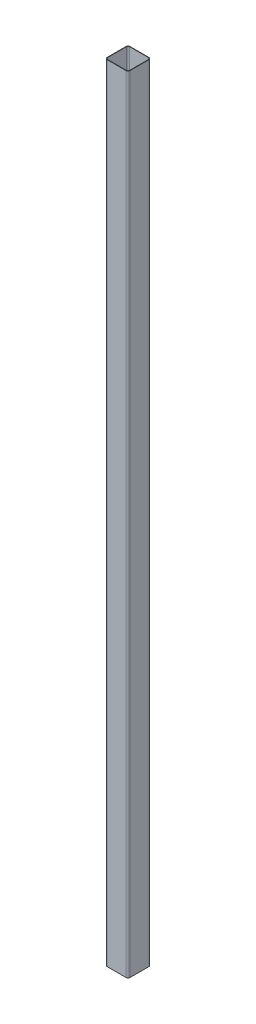
ISO-10303-21;
HEADER;
FILE_DESCRIPTION(('STEP AP214'),'2;1');
FILE_NAME('part.step','',(''),(''),'','','');
FILE_SCHEMA(('AUTOMOTIVE_DESIGN { 1 0 10303 214 1 1 1 1 }'));
ENDSEC;
DATA;
#1=APPLICATION_CONTEXT('core data for automotive mechanical design processes');
#2=APPLICATION_PROTOCOL_DEFINITION('international standard','automotive_design',2000,#1);
#3=PRODUCT_CONTEXT('',#1,'mechanical');
#4=PRODUCT('Part','Part','',(#3));
#5=PRODUCT_RELATED_PRODUCT_CATEGORY('part','',(#4));
#6=PRODUCT_DEFINITION_FORMATION('','',#4);
#7=PRODUCT_DEFINITION_CONTEXT('part definition',#1,'design');
#8=PRODUCT_DEFINITION('design','',#6,#7);
#9=PRODUCT_DEFINITION_SHAPE('','',#8);
#10=(LENGTH_UNIT() NAMED_UNIT(*) SI_UNIT(.MILLI.,.METRE.));
#11=(NAMED_UNIT(*) PLANE_ANGLE_UNIT() SI_UNIT($,.RADIAN.));
#12=(NAMED_UNIT(*) SI_UNIT($,.STERADIAN.) SOLID_ANGLE_UNIT());
#13=UNCERTAINTY_MEASURE_WITH_UNIT(LENGTH_MEASURE(1.E-05),#10,'distance_accuracy_value','');
#14=(GEOMETRIC_REPRESENTATION_CONTEXT(3) GLOBAL_UNCERTAINTY_ASSIGNED_CONTEXT((#13)) GLOBAL_UNIT_ASSIGNED_CONTEXT((#10,
#11,#12)) REPRESENTATION_CONTEXT('',''));
#15=CARTESIAN_POINT('',(0.,0.,0.));
#16=DIRECTION('',(0.,0.,1.));
#17=DIRECTION('',(1.,0.,0.));
#18=AXIS2_PLACEMENT_3D('',#15,#16,#17);
#19=CARTESIAN_POINT('',(-14.605,1219.2,14.605));
#20=DIRECTION('',(0.,1.,0.));
#21=DIRECTION('',(0.,0.,1.));
#22=AXIS2_PLACEMENT_3D('',#19,#20,#21);
#23=PLANE('',#22);
#24=CARTESIAN_POINT('',(-14.605,1219.2,14.605));
#25=DIRECTION('',(0.,1.,0.));
#26=DIRECTION('',(0.,0.,1.));
#27=AXIS2_PLACEMENT_3D('',#24,#25,#26);
#28=CIRCLE('',#27,3.175);
#29=CARTESIAN_POINT('',(-17.78,1219.2,14.605));
#30=VERTEX_POINT('',#29);
#31=CARTESIAN_POINT('',(-14.605,1219.2,17.78));
#32=VERTEX_POINT('',#31);
#33=EDGE_CURVE('E250',#30,#32,#28,.T.);
#34=ORIENTED_EDGE('',*,*,#33,.T.);
#35=DIRECTION('',(1.,0.,0.));
#36=VECTOR('',#35,1.);
#37=CARTESIAN_POINT('',(14.605,1219.2,17.78));
#38=LINE('',#37,#36);
#39=CARTESIAN_POINT('',(14.605,1219.2,17.78));
#40=VERTEX_POINT('',#39);
#41=EDGE_CURVE('E253',#32,#40,#38,.T.);
#42=ORIENTED_EDGE('',*,*,#41,.T.);
#43=CARTESIAN_POINT('',(14.605,1219.2,14.605));
#44=DIRECTION('',(0.,1.,0.));
#45=DIRECTION('',(0.,0.,1.));
#46=AXIS2_PLACEMENT_3D('',#43,#44,#45);
#47=CIRCLE('',#46,3.175);
#48=CARTESIAN_POINT('',(17.78,1219.2,14.605));
#49=VERTEX_POINT('',#48);
#50=EDGE_CURVE('E256',#40,#49,#47,.T.);
#51=ORIENTED_EDGE('',*,*,#50,.T.);
#52=DIRECTION('',(0.,0.,-1.));
#53=VECTOR('',#52,1.);
#54=CARTESIAN_POINT('',(17.78,1219.2,14.605));
#55=LINE('',#54,#53);
#56=CARTESIAN_POINT('',(17.78,1219.2,-14.605));
#57=VERTEX_POINT('',#56);
#58=EDGE_CURVE('E258',#49,#57,#55,.T.);
#59=ORIENTED_EDGE('',*,*,#58,.T.);
#60=CARTESIAN_POINT('',(14.605,1219.2,-14.605));
#61=DIRECTION('',(0.,1.,0.));
#62=DIRECTION('',(0.,0.,1.));
#63=AXIS2_PLACEMENT_3D('',#60,#61,#62);
#64=CIRCLE('',#63,3.175);
#65=CARTESIAN_POINT('',(14.605,1219.2,-17.78));
#66=VERTEX_POINT('',#65);
#67=EDGE_CURVE('E260',#57,#66,#64,.T.);
#68=ORIENTED_EDGE('',*,*,#67,.T.);
#69=DIRECTION('',(-1.,0.,0.));
#70=VECTOR('',#69,1.);
#71=CARTESIAN_POINT('',(14.605,1219.2,-17.78));
#72=LINE('',#71,#70);
#73=CARTESIAN_POINT('',(-14.605,1219.2,-17.78));
#74=VERTEX_POINT('',#73);
#75=EDGE_CURVE('E262',#66,#74,#72,.T.);
#76=ORIENTED_EDGE('',*,*,#75,.T.);
#77=CARTESIAN_POINT('',(-14.605,1219.2,-14.605));
#78=DIRECTION('',(0.,1.,0.));
#79=DIRECTION('',(0.,0.,1.));
#80=AXIS2_PLACEMENT_3D('',#77,#78,#79);
#81=CIRCLE('',#80,3.175);
#82=CARTESIAN_POINT('',(-17.78,1219.2,-14.605));
#83=VERTEX_POINT('',#82);
#84=EDGE_CURVE('E264',#74,#83,#81,.T.);
#85=ORIENTED_EDGE('',*,*,#84,.T.);
#86=DIRECTION('',(0.,0.,1.));
#87=VECTOR('',#86,1.);
#88=CARTESIAN_POINT('',(-17.78,1219.2,14.605));
#89=LINE('',#88,#87);
#90=EDGE_CURVE('E266',#83,#30,#89,.T.);
#91=ORIENTED_EDGE('',*,*,#90,.T.);
#92=EDGE_LOOP('',(#34,#42,#51,#59,#68,#76,#85,#91));
#93=FACE_BOUND('',#92,.T.);
#94=DIRECTION('',(-1.,0.,0.));
#95=VECTOR('',#94,1.);
#96=CARTESIAN_POINT('',(14.605,1219.2,-17.145));
#97=LINE('',#96,#95);
#98=CARTESIAN_POINT('',(14.605,1219.2,-17.145));
#99=VERTEX_POINT('',#98);
#100=CARTESIAN_POINT('',(-14.605,1219.2,-17.145));
#101=VERTEX_POINT('',#100);
#102=EDGE_CURVE('E177',#99,#101,#97,.T.);
#103=ORIENTED_EDGE('',*,*,#102,.F.);
#104=CARTESIAN_POINT('',(14.605,1219.2,-14.605));
#105=DIRECTION('',(0.,1.,0.));
#106=DIRECTION('',(0.,0.,1.));
#107=AXIS2_PLACEMENT_3D('',#104,#105,#106);
#108=CIRCLE('',#107,2.54);
#109=CARTESIAN_POINT('',(17.145,1219.2,-14.605));
#110=VERTEX_POINT('',#109);
#111=EDGE_CURVE('E169',#110,#99,#108,.T.);
#112=ORIENTED_EDGE('',*,*,#111,.F.);
#113=DIRECTION('',(0.,0.,-1.));
#114=VECTOR('',#113,1.);
#115=CARTESIAN_POINT('',(17.145,1219.2,14.605));
#116=LINE('',#115,#114);
#117=CARTESIAN_POINT('',(17.145,1219.2,14.605));
#118=VERTEX_POINT('',#117);
#119=EDGE_CURVE('E203',#118,#110,#116,.T.);
#120=ORIENTED_EDGE('',*,*,#119,.F.);
#121=CARTESIAN_POINT('',(14.605,1219.2,14.605));
#122=DIRECTION('',(0.,1.,0.));
#123=DIRECTION('',(0.,0.,1.));
#124=AXIS2_PLACEMENT_3D('',#121,#122,#123);
#125=CIRCLE('',#124,2.54);
#126=CARTESIAN_POINT('',(14.605,1219.2,17.145));
#127=VERTEX_POINT('',#126);
#128=EDGE_CURVE('E201',#127,#118,#125,.T.);
#129=ORIENTED_EDGE('',*,*,#128,.F.);
#130=DIRECTION('',(1.,0.,0.));
#131=VECTOR('',#130,1.);
#132=CARTESIAN_POINT('',(14.605,1219.2,17.145));
#133=LINE('',#132,#131);
#134=CARTESIAN_POINT('',(-14.605,1219.2,17.145));
#135=VERTEX_POINT('',#134);
#136=EDGE_CURVE('E199',#135,#127,#133,.T.);
#137=ORIENTED_EDGE('',*,*,#136,.F.);
#138=CARTESIAN_POINT('',(-14.605,1219.2,14.605));
#139=DIRECTION('',(0.,1.,0.));
#140=DIRECTION('',(0.,0.,1.));
#141=AXIS2_PLACEMENT_3D('',#138,#139,#140);
#142=CIRCLE('',#141,2.54);
#143=CARTESIAN_POINT('',(-17.145,1219.2,14.605));
#144=VERTEX_POINT('',#143);
#145=EDGE_CURVE('E197',#144,#135,#142,.T.);
#146=ORIENTED_EDGE('',*,*,#145,.F.);
#147=DIRECTION('',(0.,0.,1.));
#148=VECTOR('',#147,1.);
#149=CARTESIAN_POINT('',(-17.145,1219.2,14.605));
#150=LINE('',#149,#148);
#151=CARTESIAN_POINT('',(-17.145,1219.2,-14.605));
#152=VERTEX_POINT('',#151);
#153=EDGE_CURVE('E193',#152,#144,#150,.T.);
#154=ORIENTED_EDGE('',*,*,#153,.F.);
#155=CARTESIAN_POINT('',(-14.605,1219.2,-14.605));
#156=DIRECTION('',(0.,1.,0.));
#157=DIRECTION('',(0.,0.,1.));
#158=AXIS2_PLACEMENT_3D('',#155,#156,#157);
#159=CIRCLE('',#158,2.54);
#160=EDGE_CURVE('E191',#101,#152,#159,.T.);
#161=ORIENTED_EDGE('',*,*,#160,.F.);
#162=EDGE_LOOP('',(#103,#112,#120,#129,#137,#146,#154,#161));
#163=FACE_BOUND('',#162,.T.);
#164=ADVANCED_FACE('F39',(#93,#163),#23,.T.);
#165=CARTESIAN_POINT('',(-14.605,0.,14.605));
#166=DIRECTION('',(0.,1.,0.));
#167=DIRECTION('',(0.,0.,1.));
#168=AXIS2_PLACEMENT_3D('',#165,#166,#167);
#169=PLANE('',#168);
#170=CARTESIAN_POINT('',(-14.605,0.,14.605));
#171=DIRECTION('',(0.,1.,0.));
#172=DIRECTION('',(0.,0.,1.));
#173=AXIS2_PLACEMENT_3D('',#170,#171,#172);
#174=CIRCLE('',#173,3.175);
#175=CARTESIAN_POINT('',(-17.78,0.,14.605));
#176=VERTEX_POINT('',#175);
#177=CARTESIAN_POINT('',(-14.605,0.,17.78));
#178=VERTEX_POINT('',#177);
#179=EDGE_CURVE('E186',#176,#178,#174,.T.);
#180=ORIENTED_EDGE('',*,*,#179,.F.);
#181=DIRECTION('',(0.,0.,1.));
#182=VECTOR('',#181,1.);
#183=CARTESIAN_POINT('',(-17.78,0.,14.605));
#184=LINE('',#183,#182);
#185=CARTESIAN_POINT('',(-17.78,0.,-14.605));
#186=VERTEX_POINT('',#185);
#187=EDGE_CURVE('E254',#186,#176,#184,.T.);
#188=ORIENTED_EDGE('',*,*,#187,.F.);
#189=CARTESIAN_POINT('',(-14.605,0.,-14.605));
#190=DIRECTION('',(0.,1.,0.));
#191=DIRECTION('',(0.,0.,1.));
#192=AXIS2_PLACEMENT_3D('',#189,#190,#191);
#193=CIRCLE('',#192,3.175);
#194=CARTESIAN_POINT('',(-14.605,0.,-17.78));
#195=VERTEX_POINT('',#194);
#196=EDGE_CURVE('E287',#195,#186,#193,.T.);
#197=ORIENTED_EDGE('',*,*,#196,.F.);
#198=DIRECTION('',(-1.,0.,0.));
#199=VECTOR('',#198,1.);
#200=CARTESIAN_POINT('',(14.605,0.,-17.78));
#201=LINE('',#200,#199);
#202=CARTESIAN_POINT('',(14.605,0.,-17.78));
#203=VERTEX_POINT('',#202);
#204=EDGE_CURVE('E284',#203,#195,#201,.T.);
#205=ORIENTED_EDGE('',*,*,#204,.F.);
#206=CARTESIAN_POINT('',(14.605,0.,-14.605));
#207=DIRECTION('',(0.,1.,0.));
#208=DIRECTION('',(0.,0.,1.));
#209=AXIS2_PLACEMENT_3D('',#206,#207,#208);
#210=CIRCLE('',#209,3.175);
#211=CARTESIAN_POINT('',(17.78,0.,-14.605));
#212=VERTEX_POINT('',#211);
#213=EDGE_CURVE('E281',#212,#203,#210,.T.);
#214=ORIENTED_EDGE('',*,*,#213,.F.);
#215=DIRECTION('',(0.,0.,-1.));
#216=VECTOR('',#215,1.);
#217=CARTESIAN_POINT('',(17.78,0.,14.605));
#218=LINE('',#217,#216);
#219=CARTESIAN_POINT('',(17.78,0.,14.605));
#220=VERTEX_POINT('',#219);
#221=EDGE_CURVE('E278',#220,#212,#218,.T.);
#222=ORIENTED_EDGE('',*,*,#221,.F.);
#223=CARTESIAN_POINT('',(14.605,0.,14.605));
#224=DIRECTION('',(0.,1.,0.));
#225=DIRECTION('',(0.,0.,1.));
#226=AXIS2_PLACEMENT_3D('',#223,#224,#225);
#227=CIRCLE('',#226,3.175);
#228=CARTESIAN_POINT('',(14.605,0.,17.78));
#229=VERTEX_POINT('',#228);
#230=EDGE_CURVE('E275',#229,#220,#227,.T.);
#231=ORIENTED_EDGE('',*,*,#230,.F.);
#232=DIRECTION('',(1.,0.,0.));
#233=VECTOR('',#232,1.);
#234=CARTESIAN_POINT('',(14.605,0.,17.78));
#235=LINE('',#234,#233);
#236=EDGE_CURVE('E272',#178,#229,#235,.T.);
#237=ORIENTED_EDGE('',*,*,#236,.F.);
#238=EDGE_LOOP('',(#180,#188,#197,#205,#214,#222,#231,#237));
#239=FACE_BOUND('',#238,.T.);
#240=CARTESIAN_POINT('',(14.605,0.,-14.605));
#241=DIRECTION('',(0.,1.,0.));
#242=DIRECTION('',(0.,0.,1.));
#243=AXIS2_PLACEMENT_3D('',#240,#241,#242);
#244=CIRCLE('',#243,2.54);
#245=CARTESIAN_POINT('',(17.145,0.,-14.605));
#246=VERTEX_POINT('',#245);
#247=CARTESIAN_POINT('',(14.605,0.,-17.145));
#248=VERTEX_POINT('',#247);
#249=EDGE_CURVE('E66',#246,#248,#244,.T.);
#250=ORIENTED_EDGE('',*,*,#249,.T.);
#251=DIRECTION('',(-1.,0.,0.));
#252=VECTOR('',#251,1.);
#253=CARTESIAN_POINT('',(14.605,0.,-17.145));
#254=LINE('',#253,#252);
#255=CARTESIAN_POINT('',(-14.605,0.,-17.145));
#256=VERTEX_POINT('',#255);
#257=EDGE_CURVE('E184',#248,#256,#254,.T.);
#258=ORIENTED_EDGE('',*,*,#257,.T.);
#259=CARTESIAN_POINT('',(-14.605,0.,-14.605));
#260=DIRECTION('',(0.,1.,0.));
#261=DIRECTION('',(0.,0.,1.));
#262=AXIS2_PLACEMENT_3D('',#259,#260,#261);
#263=CIRCLE('',#262,2.54);
#264=CARTESIAN_POINT('',(-17.145,0.,-14.605));
#265=VERTEX_POINT('',#264);
#266=EDGE_CURVE('E209',#256,#265,#263,.T.);
#267=ORIENTED_EDGE('',*,*,#266,.T.);
#268=DIRECTION('',(0.,0.,1.));
#269=VECTOR('',#268,1.);
#270=CARTESIAN_POINT('',(-17.145,0.,14.605));
#271=LINE('',#270,#269);
#272=CARTESIAN_POINT('',(-17.145,0.,14.605));
#273=VERTEX_POINT('',#272);
#274=EDGE_CURVE('E213',#265,#273,#271,.T.);
#275=ORIENTED_EDGE('',*,*,#274,.T.);
#276=CARTESIAN_POINT('',(-14.605,0.,14.605));
#277=DIRECTION('',(0.,1.,0.));
#278=DIRECTION('',(0.,0.,1.));
#279=AXIS2_PLACEMENT_3D('',#276,#277,#278);
#280=CIRCLE('',#279,2.54);
#281=CARTESIAN_POINT('',(-14.605,0.,17.145));
#282=VERTEX_POINT('',#281);
#283=EDGE_CURVE('E217',#273,#282,#280,.T.);
#284=ORIENTED_EDGE('',*,*,#283,.T.);
#285=DIRECTION('',(1.,0.,0.));
#286=VECTOR('',#285,1.);
#287=CARTESIAN_POINT('',(14.605,0.,17.145));
#288=LINE('',#287,#286);
#289=CARTESIAN_POINT('',(14.605,0.,17.145));
#290=VERTEX_POINT('',#289);
#291=EDGE_CURVE('E221',#282,#290,#288,.T.);
#292=ORIENTED_EDGE('',*,*,#291,.T.);
#293=CARTESIAN_POINT('',(14.605,0.,14.605));
#294=DIRECTION('',(0.,1.,0.));
#295=DIRECTION('',(0.,0.,1.));
#296=AXIS2_PLACEMENT_3D('',#293,#294,#295);
#297=CIRCLE('',#296,2.54);
#298=CARTESIAN_POINT('',(17.145,0.,14.605));
#299=VERTEX_POINT('',#298);
#300=EDGE_CURVE('E225',#290,#299,#297,.T.);
#301=ORIENTED_EDGE('',*,*,#300,.T.);
#302=DIRECTION('',(0.,0.,-1.));
#303=VECTOR('',#302,1.);
#304=CARTESIAN_POINT('',(17.145,0.,14.605));
#305=LINE('',#304,#303);
#306=EDGE_CURVE('E178',#299,#246,#305,.T.);
#307=ORIENTED_EDGE('',*,*,#306,.T.);
#308=EDGE_LOOP('',(#250,#258,#267,#275,#284,#292,#301,#307));
#309=FACE_BOUND('',#308,.T.);
#310=ADVANCED_FACE('F326',(#239,#309),#169,.F.);
#311=CARTESIAN_POINT('',(-14.605,1219.2,14.605));
#312=DIRECTION('',(0.,-1.,0.));
#313=DIRECTION('',(0.,0.,-1.));
#314=AXIS2_PLACEMENT_3D('',#311,#312,#313);
#315=CYLINDRICAL_SURFACE('',#314,3.175);
#316=ORIENTED_EDGE('',*,*,#179,.T.);
#317=DIRECTION('',(0.,-1.,0.));
#318=VECTOR('',#317,1.);
#319=CARTESIAN_POINT('',(-14.605,1219.2,17.78));
#320=LINE('',#319,#318);
#321=EDGE_CURVE('E11',#32,#178,#320,.T.);
#322=ORIENTED_EDGE('',*,*,#321,.F.);
#323=ORIENTED_EDGE('',*,*,#33,.F.);
#324=DIRECTION('',(0.,-1.,0.));
#325=VECTOR('',#324,1.);
#326=CARTESIAN_POINT('',(-17.78,1219.2,14.605));
#327=LINE('',#326,#325);
#328=EDGE_CURVE('E268',#30,#176,#327,.T.);
#329=ORIENTED_EDGE('',*,*,#328,.T.);
#330=EDGE_LOOP('',(#316,#322,#323,#329));
#331=FACE_BOUND('',#330,.T.);
#332=ADVANCED_FACE('F41',(#331),#315,.T.);
#333=CARTESIAN_POINT('',(14.605,1219.2,17.78));
#334=DIRECTION('',(0.,0.,-1.));
#335=DIRECTION('',(-1.,0.,0.));
#336=AXIS2_PLACEMENT_3D('',#333,#334,#335);
#337=PLANE('',#336);
#338=ORIENTED_EDGE('',*,*,#236,.T.);
#339=DIRECTION('',(0.,-1.,0.));
#340=VECTOR('',#339,1.);
#341=CARTESIAN_POINT('',(14.605,1219.2,17.78));
#342=LINE('',#341,#340);
#343=EDGE_CURVE('E48',#40,#229,#342,.T.);
#344=ORIENTED_EDGE('',*,*,#343,.F.);
#345=ORIENTED_EDGE('',*,*,#41,.F.);
#346=ORIENTED_EDGE('',*,*,#321,.T.);
#347=EDGE_LOOP('',(#338,#344,#345,#346));
#348=FACE_BOUND('',#347,.T.);
#349=ADVANCED_FACE('F343',(#348),#337,.F.);
#350=CARTESIAN_POINT('',(14.605,1219.2,14.605));
#351=DIRECTION('',(0.,-1.,0.));
#352=DIRECTION('',(0.,0.,-1.));
#353=AXIS2_PLACEMENT_3D('',#350,#351,#352);
#354=CYLINDRICAL_SURFACE('',#353,3.175);
#355=ORIENTED_EDGE('',*,*,#230,.T.);
#356=DIRECTION('',(0.,-1.,0.));
#357=VECTOR('',#356,1.);
#358=CARTESIAN_POINT('',(17.78,1219.2,14.605));
#359=LINE('',#358,#357);
#360=EDGE_CURVE('E311',#49,#220,#359,.T.);
#361=ORIENTED_EDGE('',*,*,#360,.F.);
#362=ORIENTED_EDGE('',*,*,#50,.F.);
#363=ORIENTED_EDGE('',*,*,#343,.T.);
#364=EDGE_LOOP('',(#355,#361,#362,#363));
#365=FACE_BOUND('',#364,.T.);
#366=ADVANCED_FACE('F320',(#365),#354,.T.);
#367=CARTESIAN_POINT('',(17.78,1219.2,14.605));
#368=DIRECTION('',(-1.,0.,0.));
#369=DIRECTION('',(0.,0.,1.));
#370=AXIS2_PLACEMENT_3D('',#367,#368,#369);
#371=PLANE('',#370);
#372=ORIENTED_EDGE('',*,*,#221,.T.);
#373=DIRECTION('',(0.,-1.,0.));
#374=VECTOR('',#373,1.);
#375=CARTESIAN_POINT('',(17.78,1219.2,-14.605));
#376=LINE('',#375,#374);
#377=EDGE_CURVE('E307',#57,#212,#376,.T.);
#378=ORIENTED_EDGE('',*,*,#377,.F.);
#379=ORIENTED_EDGE('',*,*,#58,.F.);
#380=ORIENTED_EDGE('',*,*,#360,.T.);
#381=EDGE_LOOP('',(#372,#378,#379,#380));
#382=FACE_BOUND('',#381,.T.);
#383=ADVANCED_FACE('F332',(#382),#371,.F.);
#384=CARTESIAN_POINT('',(14.605,1219.2,-14.605));
#385=DIRECTION('',(0.,-1.,0.));
#386=DIRECTION('',(0.,0.,-1.));
#387=AXIS2_PLACEMENT_3D('',#384,#385,#386);
#388=CYLINDRICAL_SURFACE('',#387,3.175);
#389=ORIENTED_EDGE('',*,*,#213,.T.);
#390=DIRECTION('',(0.,-1.,0.));
#391=VECTOR('',#390,1.);
#392=CARTESIAN_POINT('',(14.605,1219.2,-17.78));
#393=LINE('',#392,#391);
#394=EDGE_CURVE('E303',#66,#203,#393,.T.);
#395=ORIENTED_EDGE('',*,*,#394,.F.);
#396=ORIENTED_EDGE('',*,*,#67,.F.);
#397=ORIENTED_EDGE('',*,*,#377,.T.);
#398=EDGE_LOOP('',(#389,#395,#396,#397));
#399=FACE_BOUND('',#398,.T.);
#400=ADVANCED_FACE('F336',(#399),#388,.T.);
#401=CARTESIAN_POINT('',(14.605,1219.2,-17.78));
#402=DIRECTION('',(0.,0.,1.));
#403=DIRECTION('',(1.,0.,0.));
#404=AXIS2_PLACEMENT_3D('',#401,#402,#403);
#405=PLANE('',#404);
#406=ORIENTED_EDGE('',*,*,#204,.T.);
#407=DIRECTION('',(0.,-1.,0.));
#408=VECTOR('',#407,1.);
#409=CARTESIAN_POINT('',(-14.605,1219.2,-17.78));
#410=LINE('',#409,#408);
#411=EDGE_CURVE('E299',#74,#195,#410,.T.);
#412=ORIENTED_EDGE('',*,*,#411,.F.);
#413=ORIENTED_EDGE('',*,*,#75,.F.);
#414=ORIENTED_EDGE('',*,*,#394,.T.);
#415=EDGE_LOOP('',(#406,#412,#413,#414));
#416=FACE_BOUND('',#415,.T.);
#417=ADVANCED_FACE('F356',(#416),#405,.F.);
#418=CARTESIAN_POINT('',(-14.605,1219.2,-14.605));
#419=DIRECTION('',(0.,-1.,0.));
#420=DIRECTION('',(0.,0.,-1.));
#421=AXIS2_PLACEMENT_3D('',#418,#419,#420);
#422=CYLINDRICAL_SURFACE('',#421,3.175);
#423=ORIENTED_EDGE('',*,*,#196,.T.);
#424=DIRECTION('',(0.,-1.,0.));
#425=VECTOR('',#424,1.);
#426=CARTESIAN_POINT('',(-17.78,1219.2,-14.605));
#427=LINE('',#426,#425);
#428=EDGE_CURVE('E295',#83,#186,#427,.T.);
#429=ORIENTED_EDGE('',*,*,#428,.F.);
#430=ORIENTED_EDGE('',*,*,#84,.F.);
#431=ORIENTED_EDGE('',*,*,#411,.T.);
#432=EDGE_LOOP('',(#423,#429,#430,#431));
#433=FACE_BOUND('',#432,.T.);
#434=ADVANCED_FACE('F354',(#433),#422,.T.);
#435=CARTESIAN_POINT('',(-17.78,1219.2,14.605));
#436=DIRECTION('',(1.,0.,0.));
#437=DIRECTION('',(0.,0.,-1.));
#438=AXIS2_PLACEMENT_3D('',#435,#436,#437);
#439=PLANE('',#438);
#440=ORIENTED_EDGE('',*,*,#187,.T.);
#441=ORIENTED_EDGE('',*,*,#328,.F.);
#442=ORIENTED_EDGE('',*,*,#90,.F.);
#443=ORIENTED_EDGE('',*,*,#428,.T.);
#444=EDGE_LOOP('',(#440,#441,#442,#443));
#445=FACE_BOUND('',#444,.T.);
#446=ADVANCED_FACE('F349',(#445),#439,.F.);
#447=CARTESIAN_POINT('',(14.605,1219.2,-14.605));
#448=DIRECTION('',(0.,-1.,0.));
#449=DIRECTION('',(0.,0.,-1.));
#450=AXIS2_PLACEMENT_3D('',#447,#448,#449);
#451=CYLINDRICAL_SURFACE('',#450,2.54);
#452=ORIENTED_EDGE('',*,*,#249,.F.);
#453=DIRECTION('',(0.,-1.,0.));
#454=VECTOR('',#453,1.);
#455=CARTESIAN_POINT('',(17.145,1219.2,-14.605));
#456=LINE('',#455,#454);
#457=EDGE_CURVE('E173',#110,#246,#456,.T.);
#458=ORIENTED_EDGE('',*,*,#457,.F.);
#459=ORIENTED_EDGE('',*,*,#111,.T.);
#460=DIRECTION('',(0.,-1.,0.));
#461=VECTOR('',#460,1.);
#462=CARTESIAN_POINT('',(14.605,1219.2,-17.145));
#463=LINE('',#462,#461);
#464=EDGE_CURVE('E172',#99,#248,#463,.T.);
#465=ORIENTED_EDGE('',*,*,#464,.T.);
#466=EDGE_LOOP('',(#452,#458,#459,#465));
#467=FACE_BOUND('',#466,.T.);
#468=ADVANCED_FACE('F171',(#467),#451,.F.);
#469=CARTESIAN_POINT('',(14.605,1219.2,-17.145));
#470=DIRECTION('',(0.,0.,1.));
#471=DIRECTION('',(1.,0.,0.));
#472=AXIS2_PLACEMENT_3D('',#469,#470,#471);
#473=PLANE('',#472);
#474=ORIENTED_EDGE('',*,*,#257,.F.);
#475=ORIENTED_EDGE('',*,*,#464,.F.);
#476=ORIENTED_EDGE('',*,*,#102,.T.);
#477=DIRECTION('',(0.,-1.,0.));
#478=VECTOR('',#477,1.);
#479=CARTESIAN_POINT('',(-14.605,1219.2,-17.145));
#480=LINE('',#479,#478);
#481=EDGE_CURVE('E187',#101,#256,#480,.T.);
#482=ORIENTED_EDGE('',*,*,#481,.T.);
#483=EDGE_LOOP('',(#474,#475,#476,#482));
#484=FACE_BOUND('',#483,.T.);
#485=ADVANCED_FACE('F181',(#484),#473,.T.);
#486=CARTESIAN_POINT('',(-14.605,1219.2,-14.605));
#487=DIRECTION('',(0.,-1.,0.));
#488=DIRECTION('',(0.,0.,-1.));
#489=AXIS2_PLACEMENT_3D('',#486,#487,#488);
#490=CYLINDRICAL_SURFACE('',#489,2.54);
#491=ORIENTED_EDGE('',*,*,#266,.F.);
#492=ORIENTED_EDGE('',*,*,#481,.F.);
#493=ORIENTED_EDGE('',*,*,#160,.T.);
#494=DIRECTION('',(0.,-1.,0.));
#495=VECTOR('',#494,1.);
#496=CARTESIAN_POINT('',(-17.145,1219.2,-14.605));
#497=LINE('',#496,#495);
#498=EDGE_CURVE('E245',#152,#265,#497,.T.);
#499=ORIENTED_EDGE('',*,*,#498,.T.);
#500=EDGE_LOOP('',(#491,#492,#493,#499));
#501=FACE_BOUND('',#500,.T.);
#502=ADVANCED_FACE('F381',(#501),#490,.F.);
#503=CARTESIAN_POINT('',(-17.145,1219.2,14.605));
#504=DIRECTION('',(1.,0.,0.));
#505=DIRECTION('',(0.,0.,-1.));
#506=AXIS2_PLACEMENT_3D('',#503,#504,#505);
#507=PLANE('',#506);
#508=ORIENTED_EDGE('',*,*,#274,.F.);
#509=ORIENTED_EDGE('',*,*,#498,.F.);
#510=ORIENTED_EDGE('',*,*,#153,.T.);
#511=DIRECTION('',(0.,-1.,0.));
#512=VECTOR('',#511,1.);
#513=CARTESIAN_POINT('',(-17.145,1219.2,14.605));
#514=LINE('',#513,#512);
#515=EDGE_CURVE('E242',#144,#273,#514,.T.);
#516=ORIENTED_EDGE('',*,*,#515,.T.);
#517=EDGE_LOOP('',(#508,#509,#510,#516));
#518=FACE_BOUND('',#517,.T.);
#519=ADVANCED_FACE('F385',(#518),#507,.T.);
#520=CARTESIAN_POINT('',(-14.605,1219.2,14.605));
#521=DIRECTION('',(0.,-1.,0.));
#522=DIRECTION('',(0.,0.,-1.));
#523=AXIS2_PLACEMENT_3D('',#520,#521,#522);
#524=CYLINDRICAL_SURFACE('',#523,2.54);
#525=ORIENTED_EDGE('',*,*,#283,.F.);
#526=ORIENTED_EDGE('',*,*,#515,.F.);
#527=ORIENTED_EDGE('',*,*,#145,.T.);
#528=DIRECTION('',(0.,-1.,0.));
#529=VECTOR('',#528,1.);
#530=CARTESIAN_POINT('',(-14.605,1219.2,17.145));
#531=LINE('',#530,#529);
#532=EDGE_CURVE('E239',#135,#282,#531,.T.);
#533=ORIENTED_EDGE('',*,*,#532,.T.);
#534=EDGE_LOOP('',(#525,#526,#527,#533));
#535=FACE_BOUND('',#534,.T.);
#536=ADVANCED_FACE('F391',(#535),#524,.F.);
#537=CARTESIAN_POINT('',(14.605,1219.2,17.145));
#538=DIRECTION('',(0.,0.,-1.));
#539=DIRECTION('',(-1.,0.,0.));
#540=AXIS2_PLACEMENT_3D('',#537,#538,#539);
#541=PLANE('',#540);
#542=ORIENTED_EDGE('',*,*,#291,.F.);
#543=ORIENTED_EDGE('',*,*,#532,.F.);
#544=ORIENTED_EDGE('',*,*,#136,.T.);
#545=DIRECTION('',(0.,-1.,0.));
#546=VECTOR('',#545,1.);
#547=CARTESIAN_POINT('',(14.605,1219.2,17.145));
#548=LINE('',#547,#546);
#549=EDGE_CURVE('E236',#127,#290,#548,.T.);
#550=ORIENTED_EDGE('',*,*,#549,.T.);
#551=EDGE_LOOP('',(#542,#543,#544,#550));
#552=FACE_BOUND('',#551,.T.);
#553=ADVANCED_FACE('F395',(#552),#541,.T.);
#554=CARTESIAN_POINT('',(14.605,1219.2,14.605));
#555=DIRECTION('',(0.,-1.,0.));
#556=DIRECTION('',(0.,0.,-1.));
#557=AXIS2_PLACEMENT_3D('',#554,#555,#556);
#558=CYLINDRICAL_SURFACE('',#557,2.54);
#559=ORIENTED_EDGE('',*,*,#300,.F.);
#560=ORIENTED_EDGE('',*,*,#549,.F.);
#561=ORIENTED_EDGE('',*,*,#128,.T.);
#562=DIRECTION('',(0.,-1.,0.));
#563=VECTOR('',#562,1.);
#564=CARTESIAN_POINT('',(17.145,1219.2,14.605));
#565=LINE('',#564,#563);
#566=EDGE_CURVE('E55',#118,#299,#565,.T.);
#567=ORIENTED_EDGE('',*,*,#566,.T.);
#568=EDGE_LOOP('',(#559,#560,#561,#567));
#569=FACE_BOUND('',#568,.T.);
#570=ADVANCED_FACE('F399',(#569),#558,.F.);
#571=CARTESIAN_POINT('',(17.145,1219.2,14.605));
#572=DIRECTION('',(-1.,0.,0.));
#573=DIRECTION('',(0.,0.,1.));
#574=AXIS2_PLACEMENT_3D('',#571,#572,#573);
#575=PLANE('',#574);
#576=ORIENTED_EDGE('',*,*,#306,.F.);
#577=ORIENTED_EDGE('',*,*,#566,.F.);
#578=ORIENTED_EDGE('',*,*,#119,.T.);
#579=ORIENTED_EDGE('',*,*,#457,.T.);
#580=EDGE_LOOP('',(#576,#577,#578,#579));
#581=FACE_BOUND('',#580,.T.);
#582=ADVANCED_FACE('F403',(#581),#575,.T.);
#583=CLOSED_SHELL('',(#164,#310,#332,#349,#366,#383,#400,#417,#434,#446,#468,#485,#502,#519,
#536,#553,#570,#582));
#584=MANIFOLD_SOLID_BREP('B2',#583);
#585=ADVANCED_BREP_SHAPE_REPRESENTATION('',(#18,#584),#14);
#586=SHAPE_DEFINITION_REPRESENTATION(#9,#585);
ENDSEC;
END-ISO-10303-21;
